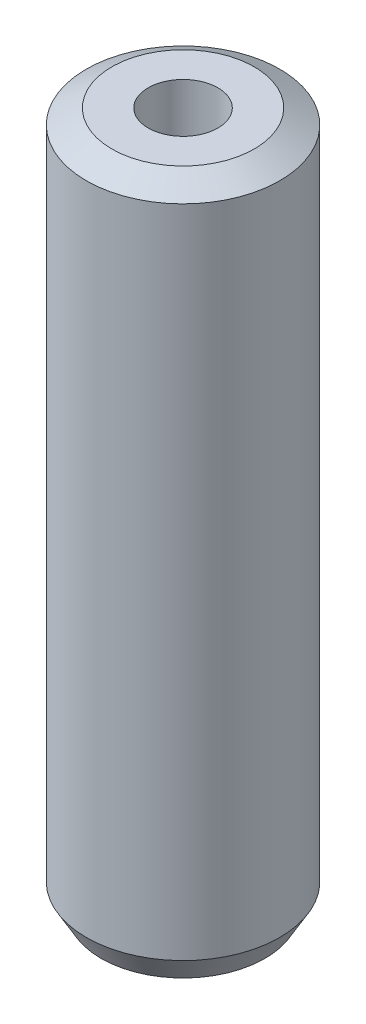
ISO-10303-21;
HEADER;
FILE_DESCRIPTION(('STEP AP214'),'2;1');
FILE_NAME('part.step','',(''),(''),'','','');
FILE_SCHEMA(('AUTOMOTIVE_DESIGN { 1 0 10303 214 1 1 1 1 }'));
ENDSEC;
DATA;
#1=APPLICATION_CONTEXT('core data for automotive mechanical design processes');
#2=APPLICATION_PROTOCOL_DEFINITION('international standard','automotive_design',2000,#1);
#3=PRODUCT_CONTEXT('',#1,'mechanical');
#4=PRODUCT('Part','Part','',(#3));
#5=PRODUCT_RELATED_PRODUCT_CATEGORY('part','',(#4));
#6=PRODUCT_DEFINITION_FORMATION('','',#4);
#7=PRODUCT_DEFINITION_CONTEXT('part definition',#1,'design');
#8=PRODUCT_DEFINITION('design','',#6,#7);
#9=PRODUCT_DEFINITION_SHAPE('','',#8);
#10=(LENGTH_UNIT() NAMED_UNIT(*) SI_UNIT(.MILLI.,.METRE.));
#11=(NAMED_UNIT(*) PLANE_ANGLE_UNIT() SI_UNIT($,.RADIAN.));
#12=(NAMED_UNIT(*) SI_UNIT($,.STERADIAN.) SOLID_ANGLE_UNIT());
#13=UNCERTAINTY_MEASURE_WITH_UNIT(LENGTH_MEASURE(1.E-05),#10,'distance_accuracy_value','');
#14=(GEOMETRIC_REPRESENTATION_CONTEXT(3) GLOBAL_UNCERTAINTY_ASSIGNED_CONTEXT((#13)) GLOBAL_UNIT_ASSIGNED_CONTEXT((#10,
#11,#12)) REPRESENTATION_CONTEXT('',''));
#15=CARTESIAN_POINT('',(0.,0.,0.));
#16=DIRECTION('',(0.,0.,1.));
#17=DIRECTION('',(1.,0.,0.));
#18=AXIS2_PLACEMENT_3D('',#15,#16,#17);
#19=CARTESIAN_POINT('',(0.,251.696371733289,0.));
#20=DIRECTION('',(0.,-1.,0.));
#21=DIRECTION('',(0.,0.,-1.));
#22=AXIS2_PLACEMENT_3D('',#19,#20,#21);
#23=CYLINDRICAL_SURFACE('',#22,35.);
#24=CARTESIAN_POINT('',(0.,246.365387139184,0.));
#25=DIRECTION('',(0.,1.,0.));
#26=DIRECTION('',(0.,0.,1.));
#27=AXIS2_PLACEMENT_3D('',#24,#25,#26);
#28=CIRCLE('',#27,35.);
#29=CARTESIAN_POINT('',(0.,246.365387139184,35.));
#30=VERTEX_POINT('',#29);
#31=EDGE_CURVE('E50',#30,#30,#28,.F.);
#32=ORIENTED_EDGE('',*,*,#31,.T.);
#33=EDGE_LOOP('',(#32));
#34=FACE_BOUND('',#33,.T.);
#35=CARTESIAN_POINT('',(0.,9.23353617135636,0.));
#36=DIRECTION('',(0.,1.,0.));
#37=DIRECTION('',(0.,0.,1.));
#38=AXIS2_PLACEMENT_3D('',#35,#36,#37);
#39=CIRCLE('',#38,35.);
#40=CARTESIAN_POINT('',(0.,9.23353617135636,35.));
#41=VERTEX_POINT('',#40);
#42=EDGE_CURVE('E51',#41,#41,#39,.T.);
#43=ORIENTED_EDGE('',*,*,#42,.T.);
#44=EDGE_LOOP('',(#43));
#45=FACE_BOUND('',#44,.T.);
#46=ADVANCED_FACE('F39',(#34,#45),#23,.T.);
#47=CARTESIAN_POINT('',(0.,251.696371733289,0.));
#48=DIRECTION('',(0.,1.,0.));
#49=DIRECTION('',(0.,0.,1.));
#50=AXIS2_PLACEMENT_3D('',#47,#48,#49);
#51=PLANE('',#50);
#52=CARTESIAN_POINT('',(0.,251.696371733289,0.));
#53=DIRECTION('',(0.,1.,0.));
#54=DIRECTION('',(0.,0.,1.));
#55=AXIS2_PLACEMENT_3D('',#52,#53,#54);
#56=CIRCLE('',#55,25.7664638286435);
#57=CARTESIAN_POINT('',(0.,251.696371733289,25.7664638286435));
#58=VERTEX_POINT('',#57);
#59=EDGE_CURVE('E54',#58,#58,#56,.T.);
#60=ORIENTED_EDGE('',*,*,#59,.T.);
#61=EDGE_LOOP('',(#60));
#62=FACE_BOUND('',#61,.T.);
#63=CARTESIAN_POINT('',(0.,251.696371733289,0.));
#64=DIRECTION('',(0.,1.,0.));
#65=DIRECTION('',(0.,0.,1.));
#66=AXIS2_PLACEMENT_3D('',#63,#64,#65);
#67=CIRCLE('',#66,12.6172731392149);
#68=CARTESIAN_POINT('',(0.,251.696371733289,12.6172731392149));
#69=VERTEX_POINT('',#68);
#70=EDGE_CURVE('E58',#69,#69,#67,.T.);
#71=ORIENTED_EDGE('',*,*,#70,.F.);
#72=EDGE_LOOP('',(#71));
#73=FACE_BOUND('',#72,.T.);
#74=ADVANCED_FACE('F69',(#62,#73),#51,.T.);
#75=CARTESIAN_POINT('',(0.,0.,0.));
#76=DIRECTION('',(0.,1.,0.));
#77=DIRECTION('',(0.,0.,1.));
#78=AXIS2_PLACEMENT_3D('',#75,#76,#77);
#79=PLANE('',#78);
#80=CARTESIAN_POINT('',(0.,0.,0.));
#81=DIRECTION('',(0.,1.,0.));
#82=DIRECTION('',(0.,0.,1.));
#83=AXIS2_PLACEMENT_3D('',#80,#81,#82);
#84=CIRCLE('',#83,29.6690154058952);
#85=CARTESIAN_POINT('',(0.,0.,29.6690154058952));
#86=VERTEX_POINT('',#85);
#87=EDGE_CURVE('E10',#86,#86,#84,.F.);
#88=ORIENTED_EDGE('',*,*,#87,.T.);
#89=EDGE_LOOP('',(#88));
#90=FACE_BOUND('',#89,.T.);
#91=CARTESIAN_POINT('',(0.,0.,0.));
#92=DIRECTION('',(0.,1.,0.));
#93=DIRECTION('',(0.,0.,1.));
#94=AXIS2_PLACEMENT_3D('',#91,#92,#93);
#95=CIRCLE('',#94,12.6172731392149);
#96=CARTESIAN_POINT('',(0.,0.,12.6172731392149));
#97=VERTEX_POINT('',#96);
#98=EDGE_CURVE('E63',#97,#97,#95,.T.);
#99=ORIENTED_EDGE('',*,*,#98,.T.);
#100=EDGE_LOOP('',(#99));
#101=FACE_BOUND('',#100,.T.);
#102=ADVANCED_FACE('F75',(#90,#101),#79,.F.);
#103=CARTESIAN_POINT('',(0.,251.696371733289,0.));
#104=DIRECTION('',(0.,-1.,0.));
#105=DIRECTION('',(0.,0.,-1.));
#106=AXIS2_PLACEMENT_3D('',#103,#104,#105);
#107=CYLINDRICAL_SURFACE('',#106,12.6172731392149);
#108=ORIENTED_EDGE('',*,*,#70,.T.);
#109=EDGE_LOOP('',(#108));
#110=FACE_BOUND('',#109,.T.);
#111=ORIENTED_EDGE('',*,*,#98,.F.);
#112=EDGE_LOOP('',(#111));
#113=FACE_BOUND('',#112,.T.);
#114=ADVANCED_FACE('F70',(#110,#113),#107,.F.);
#115=CARTESIAN_POINT('',(0.,251.696371733289,0.));
#116=DIRECTION('',(0.,-1.,0.));
#117=DIRECTION('',(0.,0.,-1.));
#118=AXIS2_PLACEMENT_3D('',#115,#116,#117);
#119=CONICAL_SURFACE('',#118,25.7664638286435,1.0471975511966);
#120=ORIENTED_EDGE('',*,*,#31,.F.);
#121=EDGE_LOOP('',(#120));
#122=FACE_BOUND('',#121,.T.);
#123=ORIENTED_EDGE('',*,*,#59,.F.);
#124=EDGE_LOOP('',(#123));
#125=FACE_BOUND('',#124,.T.);
#126=ADVANCED_FACE('F81',(#122,#125),#119,.T.);
#127=CARTESIAN_POINT('',(0.,9.23353617135636,0.));
#128=DIRECTION('',(0.,1.,0.));
#129=DIRECTION('',(0.,0.,1.));
#130=AXIS2_PLACEMENT_3D('',#127,#128,#129);
#131=CONICAL_SURFACE('',#130,35.,0.523598775598302);
#132=ORIENTED_EDGE('',*,*,#87,.F.);
#133=EDGE_LOOP('',(#132));
#134=FACE_BOUND('',#133,.T.);
#135=ORIENTED_EDGE('',*,*,#42,.F.);
#136=EDGE_LOOP('',(#135));
#137=FACE_BOUND('',#136,.T.);
#138=ADVANCED_FACE('F45',(#134,#137),#131,.T.);
#139=CLOSED_SHELL('',(#46,#74,#102,#114,#126,#138));
#140=MANIFOLD_SOLID_BREP('B2',#139);
#141=ADVANCED_BREP_SHAPE_REPRESENTATION('',(#18,#140),#14);
#142=SHAPE_DEFINITION_REPRESENTATION(#9,#141);
ENDSEC;
END-ISO-10303-21;
